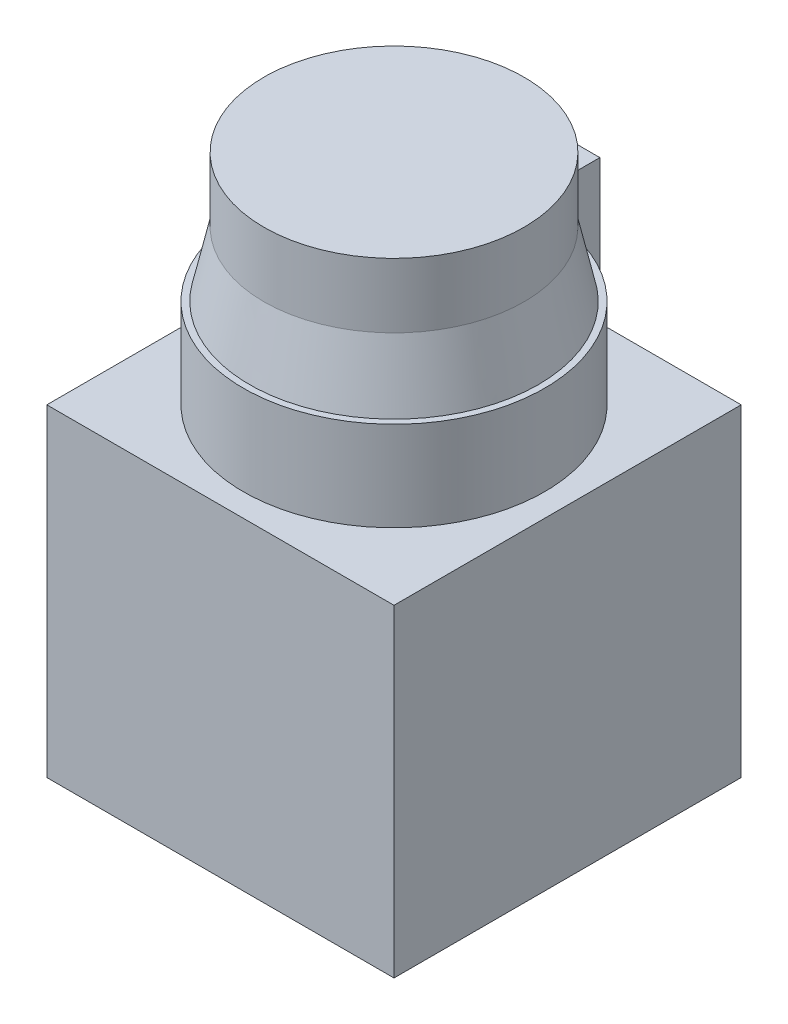
ISO-10303-21;
HEADER;
FILE_DESCRIPTION(('STEP AP214'),'2;1');
FILE_NAME('part.step','',(''),(''),'','','');
FILE_SCHEMA(('AUTOMOTIVE_DESIGN { 1 0 10303 214 1 1 1 1 }'));
ENDSEC;
DATA;
#1=APPLICATION_CONTEXT('core data for automotive mechanical design processes');
#2=APPLICATION_PROTOCOL_DEFINITION('international standard','automotive_design',2000,#1);
#3=PRODUCT_CONTEXT('',#1,'mechanical');
#4=PRODUCT('Part','Part','',(#3));
#5=PRODUCT_RELATED_PRODUCT_CATEGORY('part','',(#4));
#6=PRODUCT_DEFINITION_FORMATION('','',#4);
#7=PRODUCT_DEFINITION_CONTEXT('part definition',#1,'design');
#8=PRODUCT_DEFINITION('design','',#6,#7);
#9=PRODUCT_DEFINITION_SHAPE('','',#8);
#10=(LENGTH_UNIT() NAMED_UNIT(*) SI_UNIT(.MILLI.,.METRE.));
#11=(NAMED_UNIT(*) PLANE_ANGLE_UNIT() SI_UNIT($,.RADIAN.));
#12=(NAMED_UNIT(*) SI_UNIT($,.STERADIAN.) SOLID_ANGLE_UNIT());
#13=UNCERTAINTY_MEASURE_WITH_UNIT(LENGTH_MEASURE(1.E-05),#10,'distance_accuracy_value','');
#14=(GEOMETRIC_REPRESENTATION_CONTEXT(3) GLOBAL_UNCERTAINTY_ASSIGNED_CONTEXT((#13)) GLOBAL_UNIT_ASSIGNED_CONTEXT((#10,
#11,#12)) REPRESENTATION_CONTEXT('',''));
#15=CARTESIAN_POINT('',(0.,0.,0.));
#16=DIRECTION('',(0.,0.,1.));
#17=DIRECTION('',(1.,0.,0.));
#18=AXIS2_PLACEMENT_3D('',#15,#16,#17);
#19=CARTESIAN_POINT('',(4.5,45.,-14.));
#20=DIRECTION('',(1.,0.,0.));
#21=DIRECTION('',(0.,0.,-1.));
#22=AXIS2_PLACEMENT_3D('',#19,#20,#21);
#23=PLANE('',#22);
#24=DIRECTION('',(0.,1.,0.));
#25=VECTOR('',#24,1.);
#26=CARTESIAN_POINT('',(4.49999999999999,45.,-20.512191496766));
#27=LINE('',#26,#25);
#28=CARTESIAN_POINT('',(4.49999999999999,45.,-20.512191496766));
#29=VERTEX_POINT('',#28);
#30=CARTESIAN_POINT('',(4.49999999999999,57.5,-20.512191496766));
#31=VERTEX_POINT('',#30);
#32=EDGE_CURVE('E264',#29,#31,#27,.T.);
#33=ORIENTED_EDGE('',*,*,#32,.F.);
#34=DIRECTION('',(0.,0.,1.));
#35=VECTOR('',#34,1.);
#36=CARTESIAN_POINT('',(4.5,45.,24.2));
#37=LINE('',#36,#35);
#38=CARTESIAN_POINT('',(4.49999999999999,45.,-24.2));
#39=VERTEX_POINT('',#38);
#40=EDGE_CURVE('E202',#39,#29,#37,.T.);
#41=ORIENTED_EDGE('',*,*,#40,.F.);
#42=DIRECTION('',(0.,-1.,0.));
#43=VECTOR('',#42,1.);
#44=CARTESIAN_POINT('',(4.49999999999999,57.5,-24.2));
#45=LINE('',#44,#43);
#46=CARTESIAN_POINT('',(4.49999999999999,65.,-24.2));
#47=VERTEX_POINT('',#46);
#48=EDGE_CURVE('E639',#47,#39,#45,.T.);
#49=ORIENTED_EDGE('',*,*,#48,.F.);
#50=DIRECTION('',(0.,0.,-1.));
#51=VECTOR('',#50,1.);
#52=CARTESIAN_POINT('',(4.5,65.,-14.));
#53=LINE('',#52,#51);
#54=CARTESIAN_POINT('',(4.5,65.0000000000833,-17.9091202309064));
#55=VERTEX_POINT('',#54);
#56=EDGE_CURVE('E268',#47,#55,#53,.F.);
#57=ORIENTED_EDGE('',*,*,#56,.T.);
#58=CARTESIAN_POINT('',(4.5,65.,-17.9091202305199));
#59=CARTESIAN_POINT('',(4.5,61.4212066473393,-18.7291284043979));
#60=CARTESIAN_POINT('',(4.5,57.5,-19.6231268070854));
#61=B_SPLINE_CURVE_WITH_KNOTS('',2,(#58,#59,#60),.UNSPECIFIED.,.F.,.F.,(3,3),(0.,1.),.UNSPECIFIED.);
#62=CARTESIAN_POINT('',(4.5,57.5,-19.6231268070854));
#63=VERTEX_POINT('',#62);
#64=EDGE_CURVE('E330',#55,#63,#61,.T.);
#65=ORIENTED_EDGE('',*,*,#64,.T.);
#66=DIRECTION('',(0.,0.,1.));
#67=VECTOR('',#66,1.);
#68=CARTESIAN_POINT('',(4.49999999999999,57.5,-24.2));
#69=LINE('',#68,#67);
#70=EDGE_CURVE('E547',#31,#63,#69,.T.);
#71=ORIENTED_EDGE('',*,*,#70,.F.);
#72=EDGE_LOOP('',(#33,#41,#49,#57,#65,#71));
#73=FACE_BOUND('',#72,.T.);
#74=ADVANCED_FACE('F40',(#73),#23,.T.);
#75=CARTESIAN_POINT('',(-4.5,45.,-24.2));
#76=DIRECTION('',(-1.,0.,0.));
#77=DIRECTION('',(0.,0.,1.));
#78=AXIS2_PLACEMENT_3D('',#75,#76,#77);
#79=PLANE('',#78);
#80=DIRECTION('',(0.,0.,-1.));
#81=VECTOR('',#80,1.);
#82=CARTESIAN_POINT('',(-4.5,65.,-19.1));
#83=LINE('',#82,#81);
#84=CARTESIAN_POINT('',(-4.5,65.0000000000833,-17.9091202309064));
#85=VERTEX_POINT('',#84);
#86=CARTESIAN_POINT('',(-4.5,65.,-24.2));
#87=VERTEX_POINT('',#86);
#88=EDGE_CURVE('E574',#85,#87,#83,.T.);
#89=ORIENTED_EDGE('',*,*,#88,.T.);
#90=DIRECTION('',(0.,1.,0.));
#91=VECTOR('',#90,1.);
#92=CARTESIAN_POINT('',(-4.5,65.,-24.2));
#93=LINE('',#92,#91);
#94=CARTESIAN_POINT('',(-4.5,45.,-24.2));
#95=VERTEX_POINT('',#94);
#96=EDGE_CURVE('E255',#95,#87,#93,.T.);
#97=ORIENTED_EDGE('',*,*,#96,.F.);
#98=DIRECTION('',(0.,0.,-1.));
#99=VECTOR('',#98,1.);
#100=CARTESIAN_POINT('',(-4.5,45.,-24.2));
#101=LINE('',#100,#99);
#102=CARTESIAN_POINT('',(-4.5,45.,-20.512191496766));
#103=VERTEX_POINT('',#102);
#104=EDGE_CURVE('E251',#103,#95,#101,.T.);
#105=ORIENTED_EDGE('',*,*,#104,.F.);
#106=DIRECTION('',(0.,1.,0.));
#107=VECTOR('',#106,1.);
#108=CARTESIAN_POINT('',(-4.5,45.,-20.512191496766));
#109=LINE('',#108,#107);
#110=CARTESIAN_POINT('',(-4.5,57.5,-20.512191496766));
#111=VERTEX_POINT('',#110);
#112=EDGE_CURVE('E259',#103,#111,#109,.T.);
#113=ORIENTED_EDGE('',*,*,#112,.T.);
#114=DIRECTION('',(0.,0.,1.));
#115=VECTOR('',#114,1.);
#116=CARTESIAN_POINT('',(-4.5,57.5,-24.2));
#117=LINE('',#116,#115);
#118=CARTESIAN_POINT('',(-4.5,57.5,-19.6231268070854));
#119=VERTEX_POINT('',#118);
#120=EDGE_CURVE('E643',#111,#119,#117,.T.);
#121=ORIENTED_EDGE('',*,*,#120,.T.);
#122=CARTESIAN_POINT('',(-4.5,57.5,-19.6231268070854));
#123=CARTESIAN_POINT('',(-4.5,61.4212066473445,-18.7291284043967));
#124=CARTESIAN_POINT('',(-4.5,65.,-17.9091202305199));
#125=B_SPLINE_CURVE_WITH_KNOTS('',2,(#122,#123,#124),.UNSPECIFIED.,.F.,.F.,(3,3),(0.,1.),.UNSPECIFIED.);
#126=EDGE_CURVE('E376',#119,#85,#125,.T.);
#127=ORIENTED_EDGE('',*,*,#126,.T.);
#128=EDGE_LOOP('',(#89,#97,#105,#113,#121,#127));
#129=FACE_BOUND('',#128,.T.);
#130=ADVANCED_FACE('F315',(#129),#79,.T.);
#131=CARTESIAN_POINT('',(0.,65.,-19.1));
#132=DIRECTION('',(0.,-1.,0.));
#133=DIRECTION('',(0.,0.,-1.));
#134=AXIS2_PLACEMENT_3D('',#131,#132,#133);
#135=PLANE('',#134);
#136=ORIENTED_EDGE('',*,*,#56,.F.);
#137=DIRECTION('',(1.,0.,0.));
#138=VECTOR('',#137,1.);
#139=CARTESIAN_POINT('',(4.49999999999999,65.,-24.2));
#140=LINE('',#139,#138);
#141=EDGE_CURVE('E258',#87,#47,#140,.T.);
#142=ORIENTED_EDGE('',*,*,#141,.F.);
#143=ORIENTED_EDGE('',*,*,#88,.F.);
#144=CARTESIAN_POINT('',(0.,65.0000000001666,0.));
#145=DIRECTION('',(0.,-1.,0.));
#146=DIRECTION('',(0.,0.,-1.));
#147=AXIS2_PLACEMENT_3D('',#144,#145,#146);
#148=CIRCLE('',#147,18.465822144137);
#149=EDGE_CURVE('E336',#55,#85,#148,.F.);
#150=ORIENTED_EDGE('',*,*,#149,.F.);
#151=EDGE_LOOP('',(#136,#142,#143,#150));
#152=FACE_BOUND('',#151,.T.);
#153=ADVANCED_FACE('F321',(#152),#135,.F.);
#154=CARTESIAN_POINT('',(0.,57.4999999997501,0.));
#155=DIRECTION('',(0.,-1.,0.));
#156=DIRECTION('',(0.,0.,-1.));
#157=AXIS2_PLACEMENT_3D('',#154,#155,#156);
#158=CONICAL_SURFACE('',#157,20.1324888089297,0.218668945624076);
#159=ORIENTED_EDGE('',*,*,#126,.F.);
#160=CARTESIAN_POINT('',(0.,57.4999999997501,0.));
#161=DIRECTION('',(0.,-1.,0.));
#162=DIRECTION('',(0.,0.,-1.));
#163=AXIS2_PLACEMENT_3D('',#160,#161,#162);
#164=CIRCLE('',#163,20.1324888089297);
#165=EDGE_CURVE('E567',#119,#63,#164,.F.);
#166=ORIENTED_EDGE('',*,*,#165,.T.);
#167=ORIENTED_EDGE('',*,*,#64,.F.);
#168=ORIENTED_EDGE('',*,*,#149,.T.);
#169=EDGE_LOOP('',(#159,#166,#167,#168));
#170=FACE_BOUND('',#169,.T.);
#171=CARTESIAN_POINT('',(0.,66.5000000002499,0.));
#172=DIRECTION('',(0.,1.,0.));
#173=DIRECTION('',(0.,0.,1.));
#174=AXIS2_PLACEMENT_3D('',#171,#172,#173);
#175=CIRCLE('',#174,18.1324888100541);
#176=CARTESIAN_POINT('',(0.,66.5000000002499,18.1324888100541));
#177=VERTEX_POINT('',#176);
#178=EDGE_CURVE('E337',#177,#177,#175,.T.);
#179=ORIENTED_EDGE('',*,*,#178,.F.);
#180=EDGE_LOOP('',(#179));
#181=FACE_BOUND('',#180,.T.);
#182=ADVANCED_FACE('F389',(#170,#181),#158,.T.);
#183=CARTESIAN_POINT('',(0.,75.5,0.));
#184=DIRECTION('',(0.,-1.,0.));
#185=DIRECTION('',(0.,0.,-1.));
#186=AXIS2_PLACEMENT_3D('',#183,#184,#185);
#187=CYLINDRICAL_SURFACE('',#186,18.1324888100541);
#188=CARTESIAN_POINT('',(0.,75.5,0.));
#189=DIRECTION('',(0.,1.,0.));
#190=DIRECTION('',(0.,0.,1.));
#191=AXIS2_PLACEMENT_3D('',#188,#189,#190);
#192=CIRCLE('',#191,18.1324888100541);
#193=CARTESIAN_POINT('',(0.,75.5,18.1324888100541));
#194=VERTEX_POINT('',#193);
#195=EDGE_CURVE('E546',#194,#194,#192,.T.);
#196=ORIENTED_EDGE('',*,*,#195,.F.);
#197=EDGE_LOOP('',(#196));
#198=FACE_BOUND('',#197,.T.);
#199=ORIENTED_EDGE('',*,*,#178,.T.);
#200=EDGE_LOOP('',(#199));
#201=FACE_BOUND('',#200,.T.);
#202=ADVANCED_FACE('F327',(#198,#201),#187,.T.);
#203=CARTESIAN_POINT('',(0.,75.5,0.));
#204=DIRECTION('',(0.,1.,0.));
#205=DIRECTION('',(0.,0.,1.));
#206=AXIS2_PLACEMENT_3D('',#203,#204,#205);
#207=PLANE('',#206);
#208=ORIENTED_EDGE('',*,*,#195,.T.);
#209=EDGE_LOOP('',(#208));
#210=FACE_BOUND('',#209,.T.);
#211=ADVANCED_FACE('F524',(#210),#207,.T.);
#212=CARTESIAN_POINT('',(0.,0.,-24.2));
#213=DIRECTION('',(0.,0.,1.));
#214=DIRECTION('',(1.,0.,0.));
#215=AXIS2_PLACEMENT_3D('',#212,#213,#214);
#216=PLANE('',#215);
#217=ORIENTED_EDGE('',*,*,#96,.T.);
#218=ORIENTED_EDGE('',*,*,#141,.T.);
#219=ORIENTED_EDGE('',*,*,#48,.T.);
#220=DIRECTION('',(-1.,0.,0.));
#221=VECTOR('',#220,1.);
#222=CARTESIAN_POINT('',(24.2,45.,-24.2));
#223=LINE('',#222,#221);
#224=CARTESIAN_POINT('',(24.2,45.,-24.2));
#225=VERTEX_POINT('',#224);
#226=EDGE_CURVE('E216',#225,#39,#223,.T.);
#227=ORIENTED_EDGE('',*,*,#226,.F.);
#228=DIRECTION('',(0.,1.,0.));
#229=VECTOR('',#228,1.);
#230=CARTESIAN_POINT('',(24.2,45.,-24.2));
#231=LINE('',#230,#229);
#232=CARTESIAN_POINT('',(24.2,0.,-24.2));
#233=VERTEX_POINT('',#232);
#234=EDGE_CURVE('E211',#233,#225,#231,.T.);
#235=ORIENTED_EDGE('',*,*,#234,.F.);
#236=DIRECTION('',(1.,0.,0.));
#237=VECTOR('',#236,1.);
#238=CARTESIAN_POINT('',(4.49999999999999,0.,-24.2));
#239=LINE('',#238,#237);
#240=CARTESIAN_POINT('',(-24.2,0.,-24.2));
#241=VERTEX_POINT('',#240);
#242=EDGE_CURVE('E228',#241,#233,#239,.T.);
#243=ORIENTED_EDGE('',*,*,#242,.F.);
#244=DIRECTION('',(0.,1.,0.));
#245=VECTOR('',#244,1.);
#246=CARTESIAN_POINT('',(-24.2,0.,-24.2));
#247=LINE('',#246,#245);
#248=CARTESIAN_POINT('',(-24.2,45.,-24.2));
#249=VERTEX_POINT('',#248);
#250=EDGE_CURVE('E230',#241,#249,#247,.T.);
#251=ORIENTED_EDGE('',*,*,#250,.T.);
#252=DIRECTION('',(1.,0.,0.));
#253=VECTOR('',#252,1.);
#254=CARTESIAN_POINT('',(4.49999999999999,45.,-24.2));
#255=LINE('',#254,#253);
#256=EDGE_CURVE('E226',#249,#95,#255,.T.);
#257=ORIENTED_EDGE('',*,*,#256,.T.);
#258=EDGE_LOOP('',(#217,#218,#219,#227,#235,#243,#251,#257));
#259=FACE_BOUND('',#258,.T.);
#260=ADVANCED_FACE('F517',(#259),#216,.F.);
#261=CARTESIAN_POINT('',(0.,57.5,0.));
#262=DIRECTION('',(0.,1.,0.));
#263=DIRECTION('',(0.,0.,1.));
#264=AXIS2_PLACEMENT_3D('',#261,#262,#263);
#265=PLANE('',#264);
#266=ORIENTED_EDGE('',*,*,#120,.F.);
#267=CARTESIAN_POINT('',(0.,57.5,0.));
#268=DIRECTION('',(0.,-1.,0.));
#269=DIRECTION('',(0.,0.,1.));
#270=AXIS2_PLACEMENT_3D('',#267,#268,#269);
#271=CIRCLE('',#270,21.);
#272=EDGE_CURVE('E252',#31,#111,#271,.T.);
#273=ORIENTED_EDGE('',*,*,#272,.F.);
#274=ORIENTED_EDGE('',*,*,#70,.T.);
#275=ORIENTED_EDGE('',*,*,#165,.F.);
#276=EDGE_LOOP('',(#266,#273,#274,#275));
#277=FACE_BOUND('',#276,.T.);
#278=ADVANCED_FACE('F523',(#277),#265,.T.);
#279=CARTESIAN_POINT('',(0.,45.,0.));
#280=DIRECTION('',(0.,1.,0.));
#281=DIRECTION('',(0.,0.,1.));
#282=AXIS2_PLACEMENT_3D('',#279,#280,#281);
#283=CYLINDRICAL_SURFACE('',#282,21.);
#284=ORIENTED_EDGE('',*,*,#272,.T.);
#285=ORIENTED_EDGE('',*,*,#112,.F.);
#286=CARTESIAN_POINT('',(0.,45.,0.));
#287=DIRECTION('',(0.,-1.,0.));
#288=DIRECTION('',(0.,0.,1.));
#289=AXIS2_PLACEMENT_3D('',#286,#287,#288);
#290=CIRCLE('',#289,21.);
#291=EDGE_CURVE('E248',#29,#103,#290,.T.);
#292=ORIENTED_EDGE('',*,*,#291,.F.);
#293=ORIENTED_EDGE('',*,*,#32,.T.);
#294=EDGE_LOOP('',(#284,#285,#292,#293));
#295=FACE_BOUND('',#294,.T.);
#296=ADVANCED_FACE('F509',(#295),#283,.T.);
#297=CARTESIAN_POINT('',(-24.2,0.,24.2));
#298=DIRECTION('',(0.,0.,-1.));
#299=DIRECTION('',(-1.,0.,0.));
#300=AXIS2_PLACEMENT_3D('',#297,#298,#299);
#301=PLANE('',#300);
#302=DIRECTION('',(-1.,0.,0.));
#303=VECTOR('',#302,1.);
#304=CARTESIAN_POINT('',(-24.2,45.,24.2));
#305=LINE('',#304,#303);
#306=CARTESIAN_POINT('',(24.2,45.,24.2));
#307=VERTEX_POINT('',#306);
#308=CARTESIAN_POINT('',(-24.2,45.,24.2));
#309=VERTEX_POINT('',#308);
#310=EDGE_CURVE('E231',#307,#309,#305,.T.);
#311=ORIENTED_EDGE('',*,*,#310,.T.);
#312=DIRECTION('',(0.,1.,0.));
#313=VECTOR('',#312,1.);
#314=CARTESIAN_POINT('',(-24.2,0.,24.2));
#315=LINE('',#314,#313);
#316=CARTESIAN_POINT('',(-24.2,0.,24.2));
#317=VERTEX_POINT('',#316);
#318=EDGE_CURVE('E242',#317,#309,#315,.T.);
#319=ORIENTED_EDGE('',*,*,#318,.F.);
#320=DIRECTION('',(-1.,0.,0.));
#321=VECTOR('',#320,1.);
#322=CARTESIAN_POINT('',(-24.2,0.,24.2));
#323=LINE('',#322,#321);
#324=CARTESIAN_POINT('',(24.2,0.,24.2));
#325=VERTEX_POINT('',#324);
#326=EDGE_CURVE('E222',#325,#317,#323,.T.);
#327=ORIENTED_EDGE('',*,*,#326,.F.);
#328=DIRECTION('',(0.,-1.,0.));
#329=VECTOR('',#328,1.);
#330=CARTESIAN_POINT('',(24.2,0.,24.2));
#331=LINE('',#330,#329);
#332=EDGE_CURVE('E205',#307,#325,#331,.T.);
#333=ORIENTED_EDGE('',*,*,#332,.F.);
#334=EDGE_LOOP('',(#311,#319,#327,#333));
#335=FACE_BOUND('',#334,.T.);
#336=ADVANCED_FACE('F449',(#335),#301,.F.);
#337=CARTESIAN_POINT('',(-24.2,0.,-24.2));
#338=DIRECTION('',(1.,0.,0.));
#339=DIRECTION('',(0.,0.,-1.));
#340=AXIS2_PLACEMENT_3D('',#337,#338,#339);
#341=PLANE('',#340);
#342=DIRECTION('',(0.,1.,0.));
#343=VECTOR('',#342,1.);
#344=CARTESIAN_POINT('',(-24.2,3.,19.8));
#345=LINE('',#344,#343);
#346=CARTESIAN_POINT('',(-24.2,3.,19.8));
#347=VERTEX_POINT('',#346);
#348=CARTESIAN_POINT('',(-24.2,4.,19.8));
#349=VERTEX_POINT('',#348);
#350=EDGE_CURVE('E192',#347,#349,#345,.T.);
#351=ORIENTED_EDGE('',*,*,#350,.F.);
#352=DIRECTION('',(0.,0.,1.));
#353=VECTOR('',#352,1.);
#354=CARTESIAN_POINT('',(-24.2,3.,13.8));
#355=LINE('',#354,#353);
#356=CARTESIAN_POINT('',(-24.2,3.,13.8));
#357=VERTEX_POINT('',#356);
#358=EDGE_CURVE('E178',#357,#347,#355,.T.);
#359=ORIENTED_EDGE('',*,*,#358,.F.);
#360=DIRECTION('',(0.,-1.,0.));
#361=VECTOR('',#360,1.);
#362=CARTESIAN_POINT('',(-24.2,6.,13.8));
#363=LINE('',#362,#361);
#364=CARTESIAN_POINT('',(-24.2,4.,13.8));
#365=VERTEX_POINT('',#364);
#366=EDGE_CURVE('E183',#365,#357,#363,.T.);
#367=ORIENTED_EDGE('',*,*,#366,.F.);
#368=CARTESIAN_POINT('',(-24.2,4.,15.8));
#369=DIRECTION('',(1.,0.,0.));
#370=DIRECTION('',(0.,0.,-1.));
#371=AXIS2_PLACEMENT_3D('',#368,#369,#370);
#372=CIRCLE('',#371,2.);
#373=CARTESIAN_POINT('',(-24.2,6.,15.8));
#374=VERTEX_POINT('',#373);
#375=EDGE_CURVE('E12',#365,#374,#372,.T.);
#376=ORIENTED_EDGE('',*,*,#375,.T.);
#377=DIRECTION('',(0.,0.,-1.));
#378=VECTOR('',#377,1.);
#379=CARTESIAN_POINT('',(-24.2,6.,19.8));
#380=LINE('',#379,#378);
#381=CARTESIAN_POINT('',(-24.2,6.,17.8));
#382=VERTEX_POINT('',#381);
#383=EDGE_CURVE('E195',#382,#374,#380,.T.);
#384=ORIENTED_EDGE('',*,*,#383,.F.);
#385=CARTESIAN_POINT('',(-24.2,4.,17.8));
#386=DIRECTION('',(1.,0.,0.));
#387=DIRECTION('',(0.,0.,-1.));
#388=AXIS2_PLACEMENT_3D('',#385,#386,#387);
#389=CIRCLE('',#388,2.);
#390=EDGE_CURVE('E48',#382,#349,#389,.T.);
#391=ORIENTED_EDGE('',*,*,#390,.T.);
#392=EDGE_LOOP('',(#351,#359,#367,#376,#384,#391));
#393=FACE_BOUND('',#392,.T.);
#394=DIRECTION('',(0.,0.,-1.));
#395=VECTOR('',#394,1.);
#396=CARTESIAN_POINT('',(-24.2,45.,-24.2));
#397=LINE('',#396,#395);
#398=EDGE_CURVE('E234',#309,#249,#397,.T.);
#399=ORIENTED_EDGE('',*,*,#398,.T.);
#400=ORIENTED_EDGE('',*,*,#250,.F.);
#401=DIRECTION('',(0.,0.,-1.));
#402=VECTOR('',#401,1.);
#403=CARTESIAN_POINT('',(-24.2,0.,-24.2));
#404=LINE('',#403,#402);
#405=EDGE_CURVE('E225',#317,#241,#404,.T.);
#406=ORIENTED_EDGE('',*,*,#405,.F.);
#407=ORIENTED_EDGE('',*,*,#318,.T.);
#408=EDGE_LOOP('',(#399,#400,#406,#407));
#409=FACE_BOUND('',#408,.T.);
#410=ADVANCED_FACE('F280',(#393,#409),#341,.F.);
#411=CARTESIAN_POINT('',(0.,0.,0.));
#412=DIRECTION('',(0.,1.,0.));
#413=DIRECTION('',(0.,0.,1.));
#414=AXIS2_PLACEMENT_3D('',#411,#412,#413);
#415=PLANE('',#414);
#416=CARTESIAN_POINT('',(19.2,0.,19.2));
#417=DIRECTION('',(0.,-1.,0.));
#418=DIRECTION('',(0.,0.,-1.));
#419=AXIS2_PLACEMENT_3D('',#416,#417,#418);
#420=CIRCLE('',#419,1.24999999999999);
#421=CARTESIAN_POINT('',(19.2,0.,17.95));
#422=VERTEX_POINT('',#421);
#423=EDGE_CURVE('E168',#422,#422,#420,.T.);
#424=ORIENTED_EDGE('',*,*,#423,.F.);
#425=EDGE_LOOP('',(#424));
#426=FACE_BOUND('',#425,.T.);
#427=CARTESIAN_POINT('',(-19.2,0.,-19.2));
#428=DIRECTION('',(0.,-1.,0.));
#429=DIRECTION('',(0.,0.,-1.));
#430=AXIS2_PLACEMENT_3D('',#427,#428,#429);
#431=CIRCLE('',#430,1.24999999999999);
#432=CARTESIAN_POINT('',(-19.2,0.,-20.45));
#433=VERTEX_POINT('',#432);
#434=EDGE_CURVE('E167',#433,#433,#431,.T.);
#435=ORIENTED_EDGE('',*,*,#434,.F.);
#436=EDGE_LOOP('',(#435));
#437=FACE_BOUND('',#436,.T.);
#438=ORIENTED_EDGE('',*,*,#326,.T.);
#439=ORIENTED_EDGE('',*,*,#405,.T.);
#440=ORIENTED_EDGE('',*,*,#242,.T.);
#441=DIRECTION('',(0.,0.,-1.));
#442=VECTOR('',#441,1.);
#443=CARTESIAN_POINT('',(24.2,0.,-24.2));
#444=LINE('',#443,#442);
#445=EDGE_CURVE('E208',#325,#233,#444,.T.);
#446=ORIENTED_EDGE('',*,*,#445,.F.);
#447=EDGE_LOOP('',(#438,#439,#440,#446));
#448=FACE_BOUND('',#447,.T.);
#449=ADVANCED_FACE('F448',(#426,#437,#448),#415,.F.);
#450=CARTESIAN_POINT('',(0.,45.,0.));
#451=DIRECTION('',(0.,1.,0.));
#452=DIRECTION('',(0.,0.,1.));
#453=AXIS2_PLACEMENT_3D('',#450,#451,#452);
#454=PLANE('',#453);
#455=ORIENTED_EDGE('',*,*,#310,.F.);
#456=DIRECTION('',(0.,0.,1.));
#457=VECTOR('',#456,1.);
#458=CARTESIAN_POINT('',(24.2,45.,24.2));
#459=LINE('',#458,#457);
#460=EDGE_CURVE('E213',#225,#307,#459,.T.);
#461=ORIENTED_EDGE('',*,*,#460,.F.);
#462=ORIENTED_EDGE('',*,*,#226,.T.);
#463=ORIENTED_EDGE('',*,*,#40,.T.);
#464=ORIENTED_EDGE('',*,*,#291,.T.);
#465=ORIENTED_EDGE('',*,*,#104,.T.);
#466=ORIENTED_EDGE('',*,*,#256,.F.);
#467=ORIENTED_EDGE('',*,*,#398,.F.);
#468=EDGE_LOOP('',(#455,#461,#462,#463,#464,#465,#466,#467));
#469=FACE_BOUND('',#468,.T.);
#470=ADVANCED_FACE('F310',(#469),#454,.T.);
#471=CARTESIAN_POINT('',(24.2,0.,0.));
#472=DIRECTION('',(-1.,0.,0.));
#473=DIRECTION('',(0.,0.,1.));
#474=AXIS2_PLACEMENT_3D('',#471,#472,#473);
#475=PLANE('',#474);
#476=ORIENTED_EDGE('',*,*,#332,.T.);
#477=ORIENTED_EDGE('',*,*,#445,.T.);
#478=ORIENTED_EDGE('',*,*,#234,.T.);
#479=ORIENTED_EDGE('',*,*,#460,.T.);
#480=EDGE_LOOP('',(#476,#477,#478,#479));
#481=FACE_BOUND('',#480,.T.);
#482=ADVANCED_FACE('F303',(#481),#475,.F.);
#483=CARTESIAN_POINT('',(-19.2,3.,13.8));
#484=DIRECTION('',(0.,-1.,0.));
#485=DIRECTION('',(0.,0.,-1.));
#486=AXIS2_PLACEMENT_3D('',#483,#484,#485);
#487=PLANE('',#486);
#488=ORIENTED_EDGE('',*,*,#358,.T.);
#489=DIRECTION('',(-1.,0.,0.));
#490=VECTOR('',#489,1.);
#491=CARTESIAN_POINT('',(-19.2,3.,19.8));
#492=LINE('',#491,#490);
#493=CARTESIAN_POINT('',(-19.2,3.,19.8));
#494=VERTEX_POINT('',#493);
#495=EDGE_CURVE('E190',#494,#347,#492,.T.);
#496=ORIENTED_EDGE('',*,*,#495,.F.);
#497=DIRECTION('',(0.,0.,1.));
#498=VECTOR('',#497,1.);
#499=CARTESIAN_POINT('',(-19.2,3.,13.8));
#500=LINE('',#499,#498);
#501=CARTESIAN_POINT('',(-19.2,3.,13.8));
#502=VERTEX_POINT('',#501);
#503=EDGE_CURVE('E179',#502,#494,#500,.T.);
#504=ORIENTED_EDGE('',*,*,#503,.F.);
#505=DIRECTION('',(-1.,0.,0.));
#506=VECTOR('',#505,1.);
#507=CARTESIAN_POINT('',(-19.2,3.,13.8));
#508=LINE('',#507,#506);
#509=EDGE_CURVE('E199',#502,#357,#508,.T.);
#510=ORIENTED_EDGE('',*,*,#509,.T.);
#511=EDGE_LOOP('',(#488,#496,#504,#510));
#512=FACE_BOUND('',#511,.T.);
#513=ADVANCED_FACE('F300',(#512),#487,.F.);
#514=CARTESIAN_POINT('',(-19.2,6.,13.8));
#515=DIRECTION('',(0.,0.,-1.));
#516=DIRECTION('',(0.,1.,0.));
#517=AXIS2_PLACEMENT_3D('',#514,#515,#516);
#518=PLANE('',#517);
#519=DIRECTION('',(0.,-1.,0.));
#520=VECTOR('',#519,1.);
#521=CARTESIAN_POINT('',(-19.2,6.,13.8));
#522=LINE('',#521,#520);
#523=CARTESIAN_POINT('',(-19.2,4.,13.8));
#524=VERTEX_POINT('',#523);
#525=EDGE_CURVE('E188',#524,#502,#522,.T.);
#526=ORIENTED_EDGE('',*,*,#525,.F.);
#527=DIRECTION('',(-1.,0.,0.));
#528=VECTOR('',#527,1.);
#529=CARTESIAN_POINT('',(-24.2,4.,13.8));
#530=LINE('',#529,#528);
#531=EDGE_CURVE('E276',#524,#365,#530,.T.);
#532=ORIENTED_EDGE('',*,*,#531,.T.);
#533=ORIENTED_EDGE('',*,*,#366,.T.);
#534=ORIENTED_EDGE('',*,*,#509,.F.);
#535=EDGE_LOOP('',(#526,#532,#533,#534));
#536=FACE_BOUND('',#535,.T.);
#537=ADVANCED_FACE('F297',(#536),#518,.F.);
#538=CARTESIAN_POINT('',(-19.2,6.,19.8));
#539=DIRECTION('',(0.,1.,0.));
#540=DIRECTION('',(0.,0.,1.));
#541=AXIS2_PLACEMENT_3D('',#538,#539,#540);
#542=PLANE('',#541);
#543=DIRECTION('',(0.,0.,-1.));
#544=VECTOR('',#543,1.);
#545=CARTESIAN_POINT('',(-19.2,6.,19.8));
#546=LINE('',#545,#544);
#547=CARTESIAN_POINT('',(-19.2,6.,17.8));
#548=VERTEX_POINT('',#547);
#549=CARTESIAN_POINT('',(-19.2,6.,15.8));
#550=VERTEX_POINT('',#549);
#551=EDGE_CURVE('E186',#548,#550,#546,.T.);
#552=ORIENTED_EDGE('',*,*,#551,.F.);
#553=DIRECTION('',(-1.,0.,0.));
#554=VECTOR('',#553,1.);
#555=CARTESIAN_POINT('',(-24.2,6.,17.8));
#556=LINE('',#555,#554);
#557=EDGE_CURVE('E267',#548,#382,#556,.T.);
#558=ORIENTED_EDGE('',*,*,#557,.T.);
#559=ORIENTED_EDGE('',*,*,#383,.T.);
#560=DIRECTION('',(-1.,0.,0.));
#561=VECTOR('',#560,1.);
#562=CARTESIAN_POINT('',(-19.2,6.,15.8));
#563=LINE('',#562,#561);
#564=EDGE_CURVE('E265',#374,#550,#563,.F.);
#565=ORIENTED_EDGE('',*,*,#564,.T.);
#566=EDGE_LOOP('',(#552,#558,#559,#565));
#567=FACE_BOUND('',#566,.T.);
#568=ADVANCED_FACE('F294',(#567),#542,.F.);
#569=CARTESIAN_POINT('',(-19.2,3.,19.8));
#570=DIRECTION('',(0.,0.,1.));
#571=DIRECTION('',(1.,0.,0.));
#572=AXIS2_PLACEMENT_3D('',#569,#570,#571);
#573=PLANE('',#572);
#574=ORIENTED_EDGE('',*,*,#350,.T.);
#575=DIRECTION('',(-1.,0.,0.));
#576=VECTOR('',#575,1.);
#577=CARTESIAN_POINT('',(-19.2,4.,19.8));
#578=LINE('',#577,#576);
#579=CARTESIAN_POINT('',(-19.2,4.,19.8));
#580=VERTEX_POINT('',#579);
#581=EDGE_CURVE('E271',#349,#580,#578,.F.);
#582=ORIENTED_EDGE('',*,*,#581,.T.);
#583=DIRECTION('',(0.,1.,0.));
#584=VECTOR('',#583,1.);
#585=CARTESIAN_POINT('',(-19.2,3.,19.8));
#586=LINE('',#585,#584);
#587=EDGE_CURVE('E182',#494,#580,#586,.T.);
#588=ORIENTED_EDGE('',*,*,#587,.F.);
#589=ORIENTED_EDGE('',*,*,#495,.T.);
#590=EDGE_LOOP('',(#574,#582,#588,#589));
#591=FACE_BOUND('',#590,.T.);
#592=ADVANCED_FACE('F287',(#591),#573,.F.);
#593=CARTESIAN_POINT('',(-19.2,0.,0.));
#594=DIRECTION('',(-1.,0.,0.));
#595=DIRECTION('',(0.,0.,1.));
#596=AXIS2_PLACEMENT_3D('',#593,#594,#595);
#597=PLANE('',#596);
#598=ORIENTED_EDGE('',*,*,#587,.T.);
#599=CARTESIAN_POINT('',(-19.2,4.,17.8));
#600=DIRECTION('',(-1.,0.,0.));
#601=DIRECTION('',(0.,0.,1.));
#602=AXIS2_PLACEMENT_3D('',#599,#600,#601);
#603=CIRCLE('',#602,2.);
#604=EDGE_CURVE('E274',#580,#548,#603,.T.);
#605=ORIENTED_EDGE('',*,*,#604,.T.);
#606=ORIENTED_EDGE('',*,*,#551,.T.);
#607=CARTESIAN_POINT('',(-19.2,4.,15.8));
#608=DIRECTION('',(-1.,0.,0.));
#609=DIRECTION('',(0.,0.,1.));
#610=AXIS2_PLACEMENT_3D('',#607,#608,#609);
#611=CIRCLE('',#610,2.);
#612=EDGE_CURVE('E61',#550,#524,#611,.T.);
#613=ORIENTED_EDGE('',*,*,#612,.T.);
#614=ORIENTED_EDGE('',*,*,#525,.T.);
#615=ORIENTED_EDGE('',*,*,#503,.T.);
#616=EDGE_LOOP('',(#598,#605,#606,#613,#614,#615));
#617=FACE_BOUND('',#616,.T.);
#618=ADVANCED_FACE('F292',(#617),#597,.T.);
#619=CARTESIAN_POINT('',(-19.2,7.99999999999999,-19.2));
#620=DIRECTION('',(0.,-1.,0.));
#621=DIRECTION('',(0.,0.,-1.));
#622=AXIS2_PLACEMENT_3D('',#619,#620,#621);
#623=CONICAL_SURFACE('',#622,1.24999999999999,1.02974425867665);
#624=CARTESIAN_POINT('',(-19.2,8.75107577378444,-19.2));
#625=VERTEX_POINT('',#624);
#626=VERTEX_LOOP('',#625);
#627=FACE_BOUND('',#626,.T.);
#628=CARTESIAN_POINT('',(-19.2,7.99999999999999,-19.2));
#629=DIRECTION('',(0.,-1.,0.));
#630=DIRECTION('',(0.,0.,-1.));
#631=AXIS2_PLACEMENT_3D('',#628,#629,#630);
#632=CIRCLE('',#631,1.24999999999999);
#633=CARTESIAN_POINT('',(-19.2,7.99999999999999,-20.45));
#634=VERTEX_POINT('',#633);
#635=EDGE_CURVE('E171',#634,#634,#632,.T.);
#636=ORIENTED_EDGE('',*,*,#635,.T.);
#637=EDGE_LOOP('',(#636));
#638=FACE_BOUND('',#637,.T.);
#639=ADVANCED_FACE('F404',(#627,#638),#623,.F.);
#640=CARTESIAN_POINT('',(-19.2,0.,-19.2));
#641=DIRECTION('',(0.,-1.,0.));
#642=DIRECTION('',(0.,0.,-1.));
#643=AXIS2_PLACEMENT_3D('',#640,#641,#642);
#644=CYLINDRICAL_SURFACE('',#643,1.24999999999999);
#645=ORIENTED_EDGE('',*,*,#635,.F.);
#646=EDGE_LOOP('',(#645));
#647=FACE_BOUND('',#646,.T.);
#648=ORIENTED_EDGE('',*,*,#434,.T.);
#649=EDGE_LOOP('',(#648));
#650=FACE_BOUND('',#649,.T.);
#651=ADVANCED_FACE('F161',(#647,#650),#644,.F.);
#652=CARTESIAN_POINT('',(19.2,7.99999999999999,19.2));
#653=DIRECTION('',(0.,-1.,0.));
#654=DIRECTION('',(0.,0.,-1.));
#655=AXIS2_PLACEMENT_3D('',#652,#653,#654);
#656=CONICAL_SURFACE('',#655,1.24999999999999,1.02974425867665);
#657=CARTESIAN_POINT('',(19.2,8.75107577378444,19.2));
#658=VERTEX_POINT('',#657);
#659=VERTEX_LOOP('',#658);
#660=FACE_BOUND('',#659,.T.);
#661=CARTESIAN_POINT('',(19.2,7.99999999999999,19.2));
#662=DIRECTION('',(0.,-1.,0.));
#663=DIRECTION('',(0.,0.,-1.));
#664=AXIS2_PLACEMENT_3D('',#661,#662,#663);
#665=CIRCLE('',#664,1.24999999999999);
#666=CARTESIAN_POINT('',(19.2,7.99999999999999,17.95));
#667=VERTEX_POINT('',#666);
#668=EDGE_CURVE('E165',#667,#667,#665,.T.);
#669=ORIENTED_EDGE('',*,*,#668,.T.);
#670=EDGE_LOOP('',(#669));
#671=FACE_BOUND('',#670,.T.);
#672=ADVANCED_FACE('F157',(#660,#671),#656,.F.);
#673=CARTESIAN_POINT('',(19.2,0.,19.2));
#674=DIRECTION('',(0.,-1.,0.));
#675=DIRECTION('',(0.,0.,-1.));
#676=AXIS2_PLACEMENT_3D('',#673,#674,#675);
#677=CYLINDRICAL_SURFACE('',#676,1.24999999999999);
#678=ORIENTED_EDGE('',*,*,#668,.F.);
#679=EDGE_LOOP('',(#678));
#680=FACE_BOUND('',#679,.T.);
#681=ORIENTED_EDGE('',*,*,#423,.T.);
#682=EDGE_LOOP('',(#681));
#683=FACE_BOUND('',#682,.T.);
#684=ADVANCED_FACE('F160',(#680,#683),#677,.F.);
#685=CARTESIAN_POINT('',(-19.2,4.,17.8));
#686=DIRECTION('',(1.,0.,0.));
#687=DIRECTION('',(0.,0.,-1.));
#688=AXIS2_PLACEMENT_3D('',#685,#686,#687);
#689=CYLINDRICAL_SURFACE('',#688,2.);
#690=ORIENTED_EDGE('',*,*,#604,.F.);
#691=ORIENTED_EDGE('',*,*,#581,.F.);
#692=ORIENTED_EDGE('',*,*,#390,.F.);
#693=ORIENTED_EDGE('',*,*,#557,.F.);
#694=EDGE_LOOP('',(#690,#691,#692,#693));
#695=FACE_BOUND('',#694,.T.);
#696=ADVANCED_FACE('F290',(#695),#689,.F.);
#697=CARTESIAN_POINT('',(-19.2,4.,15.8));
#698=DIRECTION('',(1.,0.,0.));
#699=DIRECTION('',(0.,0.,-1.));
#700=AXIS2_PLACEMENT_3D('',#697,#698,#699);
#701=CYLINDRICAL_SURFACE('',#700,2.);
#702=ORIENTED_EDGE('',*,*,#612,.F.);
#703=ORIENTED_EDGE('',*,*,#564,.F.);
#704=ORIENTED_EDGE('',*,*,#375,.F.);
#705=ORIENTED_EDGE('',*,*,#531,.F.);
#706=EDGE_LOOP('',(#702,#703,#704,#705));
#707=FACE_BOUND('',#706,.T.);
#708=ADVANCED_FACE('F42',(#707),#701,.F.);
#709=CLOSED_SHELL('',(#74,#130,#153,#182,#202,#211,#260,#278,#296,#336,#410,#449,#470,#482,#513,
#537,#568,#592,#618,#639,#651,#672,#684,#696,#708));
#710=MANIFOLD_SOLID_BREP('B2',#709);
#711=ADVANCED_BREP_SHAPE_REPRESENTATION('',(#18,#710),#14);
#712=SHAPE_DEFINITION_REPRESENTATION(#9,#711);
ENDSEC;
END-ISO-10303-21;
